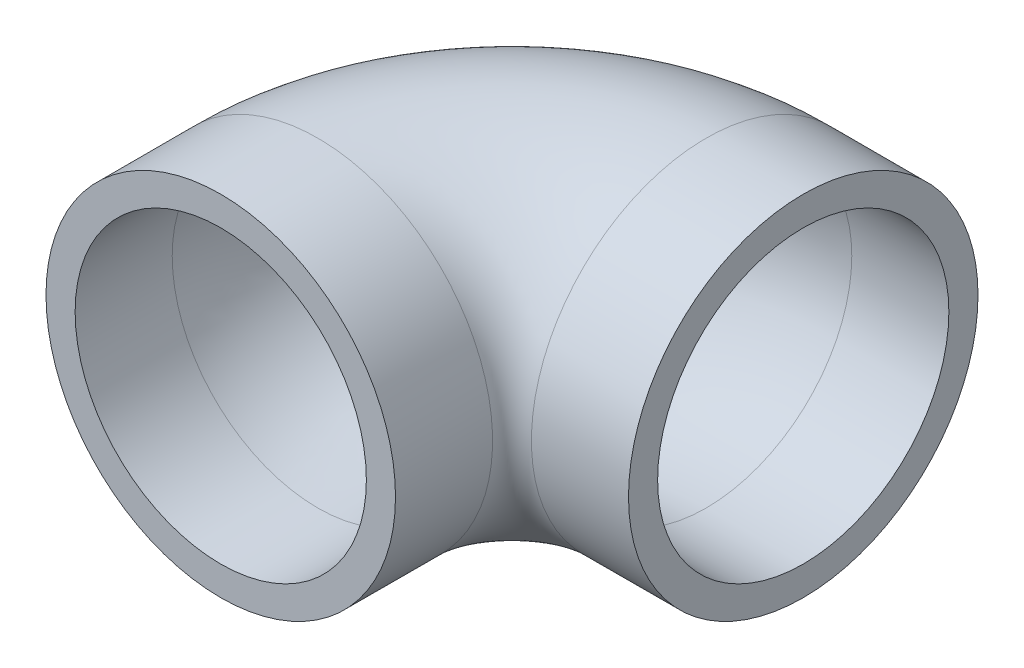
ISO-10303-21;
HEADER;
FILE_DESCRIPTION(('STEP AP214'),'2;1');
FILE_NAME('part.step','',(''),(''),'','','');
FILE_SCHEMA(('AUTOMOTIVE_DESIGN { 1 0 10303 214 1 1 1 1 }'));
ENDSEC;
DATA;
#1=APPLICATION_CONTEXT('core data for automotive mechanical design processes');
#2=APPLICATION_PROTOCOL_DEFINITION('international standard','automotive_design',2000,#1);
#3=PRODUCT_CONTEXT('',#1,'mechanical');
#4=PRODUCT('Part','Part','',(#3));
#5=PRODUCT_RELATED_PRODUCT_CATEGORY('part','',(#4));
#6=PRODUCT_DEFINITION_FORMATION('','',#4);
#7=PRODUCT_DEFINITION_CONTEXT('part definition',#1,'design');
#8=PRODUCT_DEFINITION('design','',#6,#7);
#9=PRODUCT_DEFINITION_SHAPE('','',#8);
#10=(LENGTH_UNIT() NAMED_UNIT(*) SI_UNIT(.MILLI.,.METRE.));
#11=(NAMED_UNIT(*) PLANE_ANGLE_UNIT() SI_UNIT($,.RADIAN.));
#12=(NAMED_UNIT(*) SI_UNIT($,.STERADIAN.) SOLID_ANGLE_UNIT());
#13=UNCERTAINTY_MEASURE_WITH_UNIT(LENGTH_MEASURE(1.E-05),#10,'distance_accuracy_value','');
#14=(GEOMETRIC_REPRESENTATION_CONTEXT(3) GLOBAL_UNCERTAINTY_ASSIGNED_CONTEXT((#13)) GLOBAL_UNIT_ASSIGNED_CONTEXT((#10,
#11,#12)) REPRESENTATION_CONTEXT('',''));
#15=CARTESIAN_POINT('',(0.,0.,0.));
#16=DIRECTION('',(0.,0.,1.));
#17=DIRECTION('',(1.,0.,0.));
#18=AXIS2_PLACEMENT_3D('',#15,#16,#17);
#19=CARTESIAN_POINT('',(0.,0.,0.));
#20=DIRECTION('',(0.,0.,-1.));
#21=DIRECTION('',(-1.,0.,0.));
#22=AXIS2_PLACEMENT_3D('',#19,#20,#21);
#23=CYLINDRICAL_SURFACE('',#22,22.86);
#24=CARTESIAN_POINT('',(0.,0.,-12.7));
#25=DIRECTION('',(0.,0.,1.));
#26=DIRECTION('',(1.,0.,0.));
#27=AXIS2_PLACEMENT_3D('',#24,#25,#26);
#28=CIRCLE('',#27,22.86);
#29=CARTESIAN_POINT('',(-22.86,0.,-12.7));
#30=VERTEX_POINT('',#29);
#31=EDGE_CURVE('E98',#30,#30,#28,.T.);
#32=ORIENTED_EDGE('',*,*,#31,.T.);
#33=EDGE_LOOP('',(#32));
#34=FACE_BOUND('',#33,.T.);
#35=CARTESIAN_POINT('',(0.,0.,0.));
#36=DIRECTION('',(0.,0.,1.));
#37=DIRECTION('',(1.,0.,0.));
#38=AXIS2_PLACEMENT_3D('',#35,#36,#37);
#39=CIRCLE('',#38,22.86);
#40=CARTESIAN_POINT('',(22.86,0.,0.));
#41=VERTEX_POINT('',#40);
#42=EDGE_CURVE('E47',#41,#41,#39,.T.);
#43=ORIENTED_EDGE('',*,*,#42,.F.);
#44=EDGE_LOOP('',(#43));
#45=FACE_BOUND('',#44,.T.);
#46=ADVANCED_FACE('F32',(#34,#45),#23,.T.);
#47=CARTESIAN_POINT('',(25.4,0.,-12.7));
#48=DIRECTION('',(0.,-1.,0.));
#49=DIRECTION('',(0.,0.,-1.));
#50=AXIS2_PLACEMENT_3D('',#47,#48,#49);
#51=TOROIDAL_SURFACE('',#50,25.4,22.86);
#52=CARTESIAN_POINT('',(25.4,0.,-38.1));
#53=DIRECTION('',(-1.,0.,0.));
#54=DIRECTION('',(0.,0.,1.));
#55=AXIS2_PLACEMENT_3D('',#52,#53,#54);
#56=CIRCLE('',#55,22.86);
#57=CARTESIAN_POINT('',(25.4,0.,-60.96));
#58=VERTEX_POINT('',#57);
#59=EDGE_CURVE('E36',#58,#58,#56,.T.);
#60=CARTESIAN_POINT('',(25.4,0.,-12.7));
#61=DIRECTION('',(0.,-1.,0.));
#62=DIRECTION('',(0.,0.,-1.));
#63=AXIS2_PLACEMENT_3D('',#60,#61,#62);
#64=CIRCLE('',#63,48.26);
#65=EDGE_CURVE('',#30,#58,#64,.T.);
#66=ORIENTED_EDGE('',*,*,#31,.F.);
#67=ORIENTED_EDGE('',*,*,#59,.T.);
#68=ORIENTED_EDGE('',*,*,#65,.T.);
#69=ORIENTED_EDGE('',*,*,#65,.F.);
#70=EDGE_LOOP('',(#66,#68,#67,#69));
#71=FACE_BOUND('',#70,.T.);
#72=ADVANCED_FACE('F105',(#71),#51,.T.);
#73=CARTESIAN_POINT('',(25.4,0.,-38.1));
#74=DIRECTION('',(1.,0.,0.));
#75=DIRECTION('',(0.,0.,-1.));
#76=AXIS2_PLACEMENT_3D('',#73,#74,#75);
#77=CYLINDRICAL_SURFACE('',#76,22.86);
#78=CARTESIAN_POINT('',(38.1,0.,-38.1));
#79=DIRECTION('',(-1.,0.,0.));
#80=DIRECTION('',(0.,0.,1.));
#81=AXIS2_PLACEMENT_3D('',#78,#79,#80);
#82=CIRCLE('',#81,22.86);
#83=CARTESIAN_POINT('',(38.1,0.,-15.24));
#84=VERTEX_POINT('',#83);
#85=EDGE_CURVE('E52',#84,#84,#82,.T.);
#86=ORIENTED_EDGE('',*,*,#85,.T.);
#87=EDGE_LOOP('',(#86));
#88=FACE_BOUND('',#87,.T.);
#89=ORIENTED_EDGE('',*,*,#59,.F.);
#90=EDGE_LOOP('',(#89));
#91=FACE_BOUND('',#90,.T.);
#92=ADVANCED_FACE('F34',(#88,#91),#77,.T.);
#93=CARTESIAN_POINT('',(0.,0.,0.));
#94=DIRECTION('',(0.,0.,1.));
#95=DIRECTION('',(1.,0.,0.));
#96=AXIS2_PLACEMENT_3D('',#93,#94,#95);
#97=PLANE('',#96);
#98=CARTESIAN_POINT('',(0.,0.,0.));
#99=DIRECTION('',(0.,0.,1.));
#100=DIRECTION('',(1.,0.,0.));
#101=AXIS2_PLACEMENT_3D('',#98,#99,#100);
#102=CIRCLE('',#101,19.05);
#103=CARTESIAN_POINT('',(19.05,0.,0.));
#104=VERTEX_POINT('',#103);
#105=EDGE_CURVE('E91',#104,#104,#102,.F.);
#106=ORIENTED_EDGE('',*,*,#105,.T.);
#107=EDGE_LOOP('',(#106));
#108=FACE_BOUND('',#107,.T.);
#109=ORIENTED_EDGE('',*,*,#42,.T.);
#110=EDGE_LOOP('',(#109));
#111=FACE_BOUND('',#110,.T.);
#112=ADVANCED_FACE('F65',(#108,#111),#97,.T.);
#113=CARTESIAN_POINT('',(38.1,0.,-38.1));
#114=DIRECTION('',(-1.,0.,0.));
#115=DIRECTION('',(0.,0.,1.));
#116=AXIS2_PLACEMENT_3D('',#113,#114,#115);
#117=PLANE('',#116);
#118=CARTESIAN_POINT('',(38.1,0.,-38.1));
#119=DIRECTION('',(-1.,0.,0.));
#120=DIRECTION('',(0.,0.,1.));
#121=AXIS2_PLACEMENT_3D('',#118,#119,#120);
#122=CIRCLE('',#121,19.05);
#123=CARTESIAN_POINT('',(38.1,0.,-19.05));
#124=VERTEX_POINT('',#123);
#125=EDGE_CURVE('E11',#124,#124,#122,.F.);
#126=ORIENTED_EDGE('',*,*,#125,.F.);
#127=EDGE_LOOP('',(#126));
#128=FACE_BOUND('',#127,.T.);
#129=ORIENTED_EDGE('',*,*,#85,.F.);
#130=EDGE_LOOP('',(#129));
#131=FACE_BOUND('',#130,.T.);
#132=ADVANCED_FACE('F62',(#128,#131),#117,.F.);
#133=CARTESIAN_POINT('',(0.,0.,0.));
#134=DIRECTION('',(0.,0.,-1.));
#135=DIRECTION('',(-1.,0.,0.));
#136=AXIS2_PLACEMENT_3D('',#133,#134,#135);
#137=CYLINDRICAL_SURFACE('',#136,19.05);
#138=CARTESIAN_POINT('',(0.,0.,-12.7));
#139=DIRECTION('',(0.,0.,1.));
#140=DIRECTION('',(1.,0.,0.));
#141=AXIS2_PLACEMENT_3D('',#138,#139,#140);
#142=CIRCLE('',#141,19.05);
#143=CARTESIAN_POINT('',(-19.05,0.,-12.7));
#144=VERTEX_POINT('',#143);
#145=EDGE_CURVE('E90',#144,#144,#142,.F.);
#146=ORIENTED_EDGE('',*,*,#145,.T.);
#147=EDGE_LOOP('',(#146));
#148=FACE_BOUND('',#147,.T.);
#149=ORIENTED_EDGE('',*,*,#105,.F.);
#150=EDGE_LOOP('',(#149));
#151=FACE_BOUND('',#150,.T.);
#152=ADVANCED_FACE('F64',(#148,#151),#137,.F.);
#153=CARTESIAN_POINT('',(25.4,0.,-12.7));
#154=DIRECTION('',(0.,-1.,0.));
#155=DIRECTION('',(0.,0.,-1.));
#156=AXIS2_PLACEMENT_3D('',#153,#154,#155);
#157=TOROIDAL_SURFACE('',#156,25.4,19.05);
#158=CARTESIAN_POINT('',(25.4,0.,-38.1));
#159=DIRECTION('',(-1.,0.,0.));
#160=DIRECTION('',(0.,0.,1.));
#161=AXIS2_PLACEMENT_3D('',#158,#159,#160);
#162=CIRCLE('',#161,19.05);
#163=CARTESIAN_POINT('',(25.4,0.,-57.15));
#164=VERTEX_POINT('',#163);
#165=EDGE_CURVE('E41',#164,#164,#162,.F.);
#166=CARTESIAN_POINT('',(25.4,0.,-12.7));
#167=DIRECTION('',(0.,-1.,0.));
#168=DIRECTION('',(0.,0.,-1.));
#169=AXIS2_PLACEMENT_3D('',#166,#167,#168);
#170=CIRCLE('',#169,44.45);
#171=EDGE_CURVE('',#144,#164,#170,.T.);
#172=ORIENTED_EDGE('',*,*,#145,.F.);
#173=ORIENTED_EDGE('',*,*,#165,.T.);
#174=ORIENTED_EDGE('',*,*,#171,.T.);
#175=ORIENTED_EDGE('',*,*,#171,.F.);
#176=EDGE_LOOP('',(#172,#174,#173,#175));
#177=FACE_BOUND('',#176,.T.);
#178=ADVANCED_FACE('F71',(#177),#157,.F.);
#179=CARTESIAN_POINT('',(25.4,0.,-38.1));
#180=DIRECTION('',(1.,0.,0.));
#181=DIRECTION('',(0.,0.,-1.));
#182=AXIS2_PLACEMENT_3D('',#179,#180,#181);
#183=CYLINDRICAL_SURFACE('',#182,19.05);
#184=ORIENTED_EDGE('',*,*,#125,.T.);
#185=EDGE_LOOP('',(#184));
#186=FACE_BOUND('',#185,.T.);
#187=ORIENTED_EDGE('',*,*,#165,.F.);
#188=EDGE_LOOP('',(#187));
#189=FACE_BOUND('',#188,.T.);
#190=ADVANCED_FACE('F59',(#186,#189),#183,.F.);
#191=CLOSED_SHELL('',(#46,#72,#92,#112,#132,#152,#178,#190));
#192=MANIFOLD_SOLID_BREP('B2',#191);
#193=ADVANCED_BREP_SHAPE_REPRESENTATION('',(#18,#192),#14);
#194=SHAPE_DEFINITION_REPRESENTATION(#9,#193);
ENDSEC;
END-ISO-10303-21;
